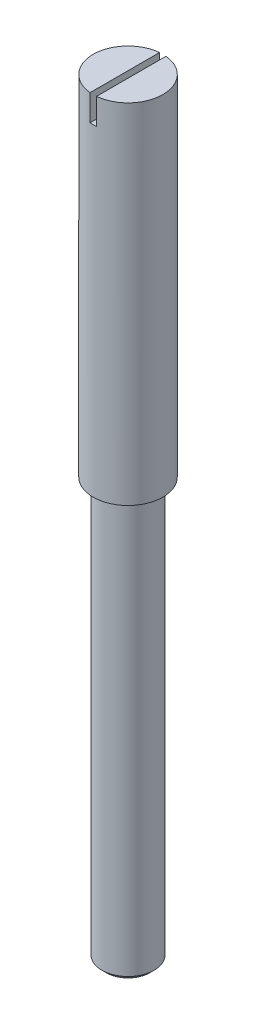
ISO-10303-21;
HEADER;
FILE_DESCRIPTION(('STEP AP214'),'2;1');
FILE_NAME('part.step','',(''),(''),'','','');
FILE_SCHEMA(('AUTOMOTIVE_DESIGN { 1 0 10303 214 1 1 1 1 }'));
ENDSEC;
DATA;
#1=APPLICATION_CONTEXT('core data for automotive mechanical design processes');
#2=APPLICATION_PROTOCOL_DEFINITION('international standard','automotive_design',2000,#1);
#3=PRODUCT_CONTEXT('',#1,'mechanical');
#4=PRODUCT('Part','Part','',(#3));
#5=PRODUCT_RELATED_PRODUCT_CATEGORY('part','',(#4));
#6=PRODUCT_DEFINITION_FORMATION('','',#4);
#7=PRODUCT_DEFINITION_CONTEXT('part definition',#1,'design');
#8=PRODUCT_DEFINITION('design','',#6,#7);
#9=PRODUCT_DEFINITION_SHAPE('','',#8);
#10=(LENGTH_UNIT() NAMED_UNIT(*) SI_UNIT(.MILLI.,.METRE.));
#11=(NAMED_UNIT(*) PLANE_ANGLE_UNIT() SI_UNIT($,.RADIAN.));
#12=(NAMED_UNIT(*) SI_UNIT($,.STERADIAN.) SOLID_ANGLE_UNIT());
#13=UNCERTAINTY_MEASURE_WITH_UNIT(LENGTH_MEASURE(1.E-05),#10,'distance_accuracy_value','');
#14=(GEOMETRIC_REPRESENTATION_CONTEXT(3) GLOBAL_UNCERTAINTY_ASSIGNED_CONTEXT((#13)) GLOBAL_UNIT_ASSIGNED_CONTEXT((#10,
#11,#12)) REPRESENTATION_CONTEXT('',''));
#15=CARTESIAN_POINT('',(0.,0.,0.));
#16=DIRECTION('',(0.,0.,1.));
#17=DIRECTION('',(1.,0.,0.));
#18=AXIS2_PLACEMENT_3D('',#15,#16,#17);
#19=CARTESIAN_POINT('',(0.5,11.,0.));
#20=DIRECTION('',(0.,1.,0.));
#21=DIRECTION('',(0.,0.,1.));
#22=AXIS2_PLACEMENT_3D('',#19,#20,#21);
#23=PLANE('',#22);
#24=DIRECTION('',(0.,0.,1.));
#25=VECTOR('',#24,1.);
#26=CARTESIAN_POINT('',(-0.0465000000000001,11.,0.));
#27=LINE('',#26,#25);
#28=CARTESIAN_POINT('',(-0.0465000000000001,11.,-0.497833054346535));
#29=VERTEX_POINT('',#28);
#30=CARTESIAN_POINT('',(-0.0465000000000001,11.,0.497833054346535));
#31=VERTEX_POINT('',#30);
#32=EDGE_CURVE('E62',#29,#31,#27,.T.);
#33=ORIENTED_EDGE('',*,*,#32,.F.);
#34=CARTESIAN_POINT('',(0.,11.,0.));
#35=DIRECTION('',(0.,-1.,0.));
#36=DIRECTION('',(0.,0.,-1.));
#37=AXIS2_PLACEMENT_3D('',#34,#35,#36);
#38=CIRCLE('',#37,0.5);
#39=EDGE_CURVE('E115',#31,#29,#38,.T.);
#40=ORIENTED_EDGE('',*,*,#39,.F.);
#41=EDGE_LOOP('',(#33,#40));
#42=FACE_BOUND('',#41,.T.);
#43=ADVANCED_FACE('F38',(#42),#23,.T.);
#44=CARTESIAN_POINT('',(0.,0.,0.));
#45=DIRECTION('',(0.,-1.,0.));
#46=DIRECTION('',(0.,0.,-1.));
#47=AXIS2_PLACEMENT_3D('',#44,#45,#46);
#48=PLANE('',#47);
#49=CARTESIAN_POINT('',(0.,0.,0.));
#50=DIRECTION('',(0.,-1.,0.));
#51=DIRECTION('',(0.,0.,-1.));
#52=AXIS2_PLACEMENT_3D('',#49,#50,#51);
#53=CIRCLE('',#52,0.312999999999998);
#54=CARTESIAN_POINT('',(0.,0.,-0.312999999999998));
#55=VERTEX_POINT('',#54);
#56=EDGE_CURVE('E47',#55,#55,#53,.T.);
#57=ORIENTED_EDGE('',*,*,#56,.T.);
#58=EDGE_LOOP('',(#57));
#59=FACE_BOUND('',#58,.T.);
#60=ADVANCED_FACE('F125',(#59),#48,.T.);
#61=CARTESIAN_POINT('',(0.,-1.49005970338395,0.));
#62=DIRECTION('',(0.,-1.,0.));
#63=DIRECTION('',(0.,0.,-1.));
#64=AXIS2_PLACEMENT_3D('',#61,#62,#63);
#65=CYLINDRICAL_SURFACE('',#64,0.375);
#66=CARTESIAN_POINT('',(0.,0.0620000000000004,0.));
#67=DIRECTION('',(0.,-1.,0.));
#68=DIRECTION('',(0.,0.,-1.));
#69=AXIS2_PLACEMENT_3D('',#66,#67,#68);
#70=CIRCLE('',#69,0.375);
#71=CARTESIAN_POINT('',(0.,0.0620000000000004,-0.375));
#72=VERTEX_POINT('',#71);
#73=EDGE_CURVE('E11',#72,#72,#70,.F.);
#74=ORIENTED_EDGE('',*,*,#73,.T.);
#75=EDGE_LOOP('',(#74));
#76=FACE_BOUND('',#75,.T.);
#77=CARTESIAN_POINT('',(0.,6.,0.));
#78=DIRECTION('',(0.,-1.,0.));
#79=DIRECTION('',(0.,0.,-1.));
#80=AXIS2_PLACEMENT_3D('',#77,#78,#79);
#81=CIRCLE('',#80,0.375);
#82=CARTESIAN_POINT('',(0.,6.,-0.375));
#83=VERTEX_POINT('',#82);
#84=EDGE_CURVE('E108',#83,#83,#81,.T.);
#85=ORIENTED_EDGE('',*,*,#84,.T.);
#86=EDGE_LOOP('',(#85));
#87=FACE_BOUND('',#86,.T.);
#88=ADVANCED_FACE('F131',(#76,#87),#65,.T.);
#89=CARTESIAN_POINT('',(0.375,6.,0.));
#90=DIRECTION('',(0.,-1.,0.));
#91=DIRECTION('',(0.,0.,-1.));
#92=AXIS2_PLACEMENT_3D('',#89,#90,#91);
#93=PLANE('',#92);
#94=CARTESIAN_POINT('',(0.,6.,0.));
#95=DIRECTION('',(0.,-1.,0.));
#96=DIRECTION('',(0.,0.,-1.));
#97=AXIS2_PLACEMENT_3D('',#94,#95,#96);
#98=CIRCLE('',#97,0.5);
#99=CARTESIAN_POINT('',(0.,6.,-0.5));
#100=VERTEX_POINT('',#99);
#101=EDGE_CURVE('E111',#100,#100,#98,.T.);
#102=ORIENTED_EDGE('',*,*,#101,.T.);
#103=EDGE_LOOP('',(#102));
#104=FACE_BOUND('',#103,.T.);
#105=ORIENTED_EDGE('',*,*,#84,.F.);
#106=EDGE_LOOP('',(#105));
#107=FACE_BOUND('',#106,.T.);
#108=ADVANCED_FACE('F141',(#104,#107),#93,.T.);
#109=CARTESIAN_POINT('',(0.,-1.49005970338395,0.));
#110=DIRECTION('',(0.,-1.,0.));
#111=DIRECTION('',(0.,0.,-1.));
#112=AXIS2_PLACEMENT_3D('',#109,#110,#111);
#113=CYLINDRICAL_SURFACE('',#112,0.5);
#114=DIRECTION('',(0.,-1.,0.));
#115=VECTOR('',#114,1.);
#116=CARTESIAN_POINT('',(-0.0464999999999987,-1.49005970338395,-0.497833054346535));
#117=LINE('',#116,#115);
#118=CARTESIAN_POINT('',(-0.0465,10.625732177946,-0.497833054346535));
#119=VERTEX_POINT('',#118);
#120=EDGE_CURVE('E102',#119,#29,#117,.F.);
#121=ORIENTED_EDGE('',*,*,#120,.F.);
#122=CARTESIAN_POINT('',(0.,10.625732177946,0.));
#123=DIRECTION('',(0.,-1.,0.));
#124=DIRECTION('',(0.,0.,-1.));
#125=AXIS2_PLACEMENT_3D('',#122,#123,#124);
#126=CIRCLE('',#125,0.5);
#127=CARTESIAN_POINT('',(0.0465,10.625732177946,-0.497833054346535));
#128=VERTEX_POINT('',#127);
#129=EDGE_CURVE('E93',#128,#119,#126,.F.);
#130=ORIENTED_EDGE('',*,*,#129,.F.);
#131=DIRECTION('',(0.,-1.,0.));
#132=VECTOR('',#131,1.);
#133=CARTESIAN_POINT('',(0.0465000000000032,-1.49005970338395,-0.497833054346535));
#134=LINE('',#133,#132);
#135=CARTESIAN_POINT('',(0.0465,11.,-0.497833054346535));
#136=VERTEX_POINT('',#135);
#137=EDGE_CURVE('E80',#136,#128,#134,.T.);
#138=ORIENTED_EDGE('',*,*,#137,.F.);
#139=CARTESIAN_POINT('',(0.0465,11.,0.497833054346535));
#140=VERTEX_POINT('',#139);
#141=EDGE_CURVE('E114',#136,#140,#38,.T.);
#142=ORIENTED_EDGE('',*,*,#141,.T.);
#143=DIRECTION('',(0.,-1.,0.));
#144=VECTOR('',#143,1.);
#145=CARTESIAN_POINT('',(0.0465000000000032,-1.49005970338395,0.497833054346535));
#146=LINE('',#145,#144);
#147=CARTESIAN_POINT('',(0.0465,10.625732177946,0.497833054346535));
#148=VERTEX_POINT('',#147);
#149=EDGE_CURVE('E54',#148,#140,#146,.F.);
#150=ORIENTED_EDGE('',*,*,#149,.F.);
#151=CARTESIAN_POINT('',(-0.0465,10.625732177946,0.497833054346535));
#152=VERTEX_POINT('',#151);
#153=EDGE_CURVE('E95',#152,#148,#126,.F.);
#154=ORIENTED_EDGE('',*,*,#153,.F.);
#155=DIRECTION('',(0.,-1.,0.));
#156=VECTOR('',#155,1.);
#157=CARTESIAN_POINT('',(-0.0464999999999987,-1.49005970338395,0.497833054346535));
#158=LINE('',#157,#156);
#159=EDGE_CURVE('E118',#31,#152,#158,.T.);
#160=ORIENTED_EDGE('',*,*,#159,.F.);
#161=ORIENTED_EDGE('',*,*,#39,.T.);
#162=EDGE_LOOP('',(#121,#130,#138,#142,#150,#154,#160,#161));
#163=FACE_BOUND('',#162,.T.);
#164=ORIENTED_EDGE('',*,*,#101,.F.);
#165=EDGE_LOOP('',(#164));
#166=FACE_BOUND('',#165,.T.);
#167=ADVANCED_FACE('F99',(#163,#166),#113,.T.);
#168=DIRECTION('',(0.,0.,-1.));
#169=VECTOR('',#168,1.);
#170=CARTESIAN_POINT('',(0.0465,11.,0.));
#171=LINE('',#170,#169);
#172=EDGE_CURVE('E84',#140,#136,#171,.T.);
#173=ORIENTED_EDGE('',*,*,#172,.F.);
#174=ORIENTED_EDGE('',*,*,#141,.F.);
#175=EDGE_LOOP('',(#173,#174));
#176=FACE_BOUND('',#175,.T.);
#177=ADVANCED_FACE('F127',(#176),#23,.T.);
#178=CARTESIAN_POINT('',(-0.0465000000000001,11.3482867811851,-0.5));
#179=DIRECTION('',(-1.,0.,0.));
#180=DIRECTION('',(0.,-1.,0.));
#181=AXIS2_PLACEMENT_3D('',#178,#179,#180);
#182=PLANE('',#181);
#183=ORIENTED_EDGE('',*,*,#120,.T.);
#184=ORIENTED_EDGE('',*,*,#32,.T.);
#185=ORIENTED_EDGE('',*,*,#159,.T.);
#186=DIRECTION('',(0.,0.,1.));
#187=VECTOR('',#186,1.);
#188=CARTESIAN_POINT('',(-0.0465,10.625732177946,-0.5));
#189=LINE('',#188,#187);
#190=EDGE_CURVE('E96',#119,#152,#189,.T.);
#191=ORIENTED_EDGE('',*,*,#190,.F.);
#192=EDGE_LOOP('',(#183,#184,#185,#191));
#193=FACE_BOUND('',#192,.T.);
#194=ADVANCED_FACE('F121',(#193),#182,.F.);
#195=CARTESIAN_POINT('',(0.0464999999999999,11.3482867811851,-0.5));
#196=DIRECTION('',(1.,0.,0.));
#197=DIRECTION('',(0.,1.,0.));
#198=AXIS2_PLACEMENT_3D('',#195,#196,#197);
#199=PLANE('',#198);
#200=ORIENTED_EDGE('',*,*,#149,.T.);
#201=ORIENTED_EDGE('',*,*,#172,.T.);
#202=ORIENTED_EDGE('',*,*,#137,.T.);
#203=DIRECTION('',(0.,0.,1.));
#204=VECTOR('',#203,1.);
#205=CARTESIAN_POINT('',(0.0465,10.625732177946,-0.5));
#206=LINE('',#205,#204);
#207=EDGE_CURVE('E83',#128,#148,#206,.T.);
#208=ORIENTED_EDGE('',*,*,#207,.T.);
#209=EDGE_LOOP('',(#200,#201,#202,#208));
#210=FACE_BOUND('',#209,.T.);
#211=ADVANCED_FACE('F82',(#210),#199,.F.);
#212=CARTESIAN_POINT('',(-0.0465,10.625732177946,-0.5));
#213=DIRECTION('',(0.,-1.,0.));
#214=DIRECTION('',(0.,0.,-1.));
#215=AXIS2_PLACEMENT_3D('',#212,#213,#214);
#216=PLANE('',#215);
#217=ORIENTED_EDGE('',*,*,#190,.T.);
#218=ORIENTED_EDGE('',*,*,#153,.T.);
#219=ORIENTED_EDGE('',*,*,#207,.F.);
#220=ORIENTED_EDGE('',*,*,#129,.T.);
#221=EDGE_LOOP('',(#217,#218,#219,#220));
#222=FACE_BOUND('',#221,.T.);
#223=ADVANCED_FACE('F92',(#222),#216,.F.);
#224=CARTESIAN_POINT('',(0.,0.,0.));
#225=DIRECTION('',(0.,1.,0.));
#226=DIRECTION('',(0.,0.,1.));
#227=AXIS2_PLACEMENT_3D('',#224,#225,#226);
#228=CONICAL_SURFACE('',#227,0.312999999999998,0.785398163397459);
#229=ORIENTED_EDGE('',*,*,#73,.F.);
#230=EDGE_LOOP('',(#229));
#231=FACE_BOUND('',#230,.T.);
#232=ORIENTED_EDGE('',*,*,#56,.F.);
#233=EDGE_LOOP('',(#232));
#234=FACE_BOUND('',#233,.T.);
#235=ADVANCED_FACE('F41',(#231,#234),#228,.T.);
#236=CLOSED_SHELL('',(#43,#60,#88,#108,#167,#177,#194,#211,#223,#235));
#237=MANIFOLD_SOLID_BREP('B2',#236);
#238=ADVANCED_BREP_SHAPE_REPRESENTATION('',(#18,#237),#14);
#239=SHAPE_DEFINITION_REPRESENTATION(#9,#238);
ENDSEC;
END-ISO-10303-21;
